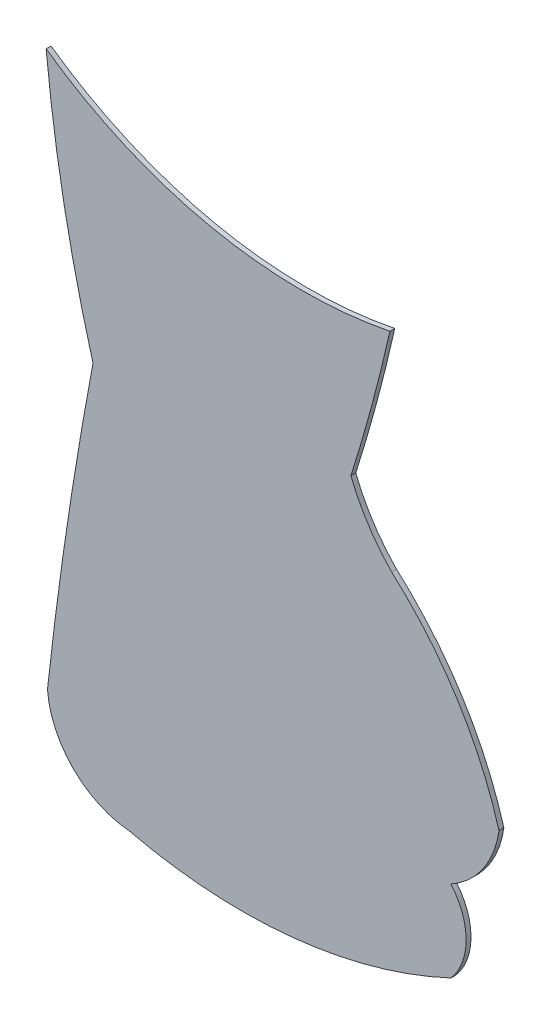
ISO-10303-21;
HEADER;
FILE_DESCRIPTION(('STEP AP214'),'2;1');
FILE_NAME('part.step','',(''),(''),'','','');
FILE_SCHEMA(('AUTOMOTIVE_DESIGN { 1 0 10303 214 1 1 1 1 }'));
ENDSEC;
DATA;
#1=APPLICATION_CONTEXT('core data for automotive mechanical design processes');
#2=APPLICATION_PROTOCOL_DEFINITION('international standard','automotive_design',2000,#1);
#3=PRODUCT_CONTEXT('',#1,'mechanical');
#4=PRODUCT('Part','Part','',(#3));
#5=PRODUCT_RELATED_PRODUCT_CATEGORY('part','',(#4));
#6=PRODUCT_DEFINITION_FORMATION('','',#4);
#7=PRODUCT_DEFINITION_CONTEXT('part definition',#1,'design');
#8=PRODUCT_DEFINITION('design','',#6,#7);
#9=PRODUCT_DEFINITION_SHAPE('','',#8);
#10=(LENGTH_UNIT() NAMED_UNIT(*) SI_UNIT(.MILLI.,.METRE.));
#11=(NAMED_UNIT(*) PLANE_ANGLE_UNIT() SI_UNIT($,.RADIAN.));
#12=(NAMED_UNIT(*) SI_UNIT($,.STERADIAN.) SOLID_ANGLE_UNIT());
#13=UNCERTAINTY_MEASURE_WITH_UNIT(LENGTH_MEASURE(1.E-05),#10,'distance_accuracy_value','');
#14=(GEOMETRIC_REPRESENTATION_CONTEXT(3) GLOBAL_UNCERTAINTY_ASSIGNED_CONTEXT((#13)) GLOBAL_UNIT_ASSIGNED_CONTEXT((#10,
#11,#12)) REPRESENTATION_CONTEXT('',''));
#15=CARTESIAN_POINT('',(0.,0.,0.));
#16=DIRECTION('',(0.,0.,1.));
#17=DIRECTION('',(1.,0.,0.));
#18=AXIS2_PLACEMENT_3D('',#15,#16,#17);
#19=CARTESIAN_POINT('',(34.7356672762744,12.8118184762911,0.1));
#20=DIRECTION('',(0.,0.,-1.));
#21=DIRECTION('',(-1.,0.,0.));
#22=AXIS2_PLACEMENT_3D('',#19,#20,#21);
#23=CYLINDRICAL_SURFACE('',#22,29.051276035575);
#24=CARTESIAN_POINT('',(34.7356672762744,12.8118184762911,0.));
#25=DIRECTION('',(0.,0.,1.));
#26=DIRECTION('',(1.,0.,0.));
#27=AXIS2_PLACEMENT_3D('',#24,#25,#26);
#28=CIRCLE('',#27,29.051276035575);
#29=CARTESIAN_POINT('',(5.82026123844377,10.0054092113117,0.));
#30=VERTEX_POINT('',#29);
#31=CARTESIAN_POINT('',(6.77972887717701,4.90978408500634,0.));
#32=VERTEX_POINT('',#31);
#33=EDGE_CURVE('E141',#30,#32,#28,.T.);
#34=ORIENTED_EDGE('',*,*,#33,.T.);
#35=DIRECTION('',(0.,0.,-1.));
#36=VECTOR('',#35,1.);
#37=CARTESIAN_POINT('',(6.77972887717701,4.90978408500634,0.1));
#38=LINE('',#37,#36);
#39=CARTESIAN_POINT('',(6.77972887717701,4.90978408500634,0.1));
#40=VERTEX_POINT('',#39);
#41=EDGE_CURVE('E11',#40,#32,#38,.T.);
#42=ORIENTED_EDGE('',*,*,#41,.F.);
#43=CARTESIAN_POINT('',(34.7356672762744,12.8118184762911,0.1));
#44=DIRECTION('',(0.,0.,1.));
#45=DIRECTION('',(1.,0.,0.));
#46=AXIS2_PLACEMENT_3D('',#43,#44,#45);
#47=CIRCLE('',#46,29.051276035575);
#48=CARTESIAN_POINT('',(5.82026123844377,10.0054092113117,0.1));
#49=VERTEX_POINT('',#48);
#50=EDGE_CURVE('E159',#49,#40,#47,.T.);
#51=ORIENTED_EDGE('',*,*,#50,.F.);
#52=DIRECTION('',(0.,0.,-1.));
#53=VECTOR('',#52,1.);
#54=CARTESIAN_POINT('',(5.82026123844377,10.0054092113117,0.1));
#55=LINE('',#54,#53);
#56=EDGE_CURVE('E137',#49,#30,#55,.T.);
#57=ORIENTED_EDGE('',*,*,#56,.T.);
#58=EDGE_LOOP('',(#34,#42,#51,#57));
#59=FACE_BOUND('',#58,.T.);
#60=ADVANCED_FACE('F33',(#59),#23,.T.);
#61=CARTESIAN_POINT('',(86.7306070023256,-10.2115855926598,0.1));
#62=DIRECTION('',(0.,0.,-1.));
#63=DIRECTION('',(-1.,0.,0.));
#64=AXIS2_PLACEMENT_3D('',#61,#62,#63);
#65=CYLINDRICAL_SURFACE('',#64,81.3682907151859);
#66=CARTESIAN_POINT('',(86.7306070023256,-10.2115855926598,0.));
#67=DIRECTION('',(0.,0.,1.));
#68=DIRECTION('',(1.,0.,0.));
#69=AXIS2_PLACEMENT_3D('',#66,#67,#68);
#70=CIRCLE('',#69,81.3682907151859);
#71=CARTESIAN_POINT('',(5.84689805543554,-1.34454770474144,0.));
#72=VERTEX_POINT('',#71);
#73=EDGE_CURVE('E144',#32,#72,#70,.T.);
#74=ORIENTED_EDGE('',*,*,#73,.T.);
#75=DIRECTION('',(0.,0.,-1.));
#76=VECTOR('',#75,1.);
#77=CARTESIAN_POINT('',(5.84689805543554,-1.34454770474144,0.1));
#78=LINE('',#77,#76);
#79=CARTESIAN_POINT('',(5.84689805543554,-1.34454770474144,0.1));
#80=VERTEX_POINT('',#79);
#81=EDGE_CURVE('E41',#80,#72,#78,.T.);
#82=ORIENTED_EDGE('',*,*,#81,.F.);
#83=CARTESIAN_POINT('',(86.7306070023256,-10.2115855926598,0.1));
#84=DIRECTION('',(0.,0.,1.));
#85=DIRECTION('',(1.,0.,0.));
#86=AXIS2_PLACEMENT_3D('',#83,#84,#85);
#87=CIRCLE('',#86,81.3682907151859);
#88=EDGE_CURVE('E98',#40,#80,#87,.T.);
#89=ORIENTED_EDGE('',*,*,#88,.F.);
#90=ORIENTED_EDGE('',*,*,#41,.T.);
#91=EDGE_LOOP('',(#74,#82,#89,#90));
#92=FACE_BOUND('',#91,.T.);
#93=ADVANCED_FACE('F208',(#92),#65,.T.);
#94=CARTESIAN_POINT('',(7.66583797220736,-1.19270495592502,0.1));
#95=DIRECTION('',(0.,0.,-1.));
#96=DIRECTION('',(-1.,0.,0.));
#97=AXIS2_PLACEMENT_3D('',#94,#95,#96);
#98=CYLINDRICAL_SURFACE('',#97,1.82526673152008);
#99=CARTESIAN_POINT('',(7.66583797220736,-1.19270495592502,0.));
#100=DIRECTION('',(0.,0.,1.));
#101=DIRECTION('',(1.,0.,0.));
#102=AXIS2_PLACEMENT_3D('',#99,#100,#101);
#103=CIRCLE('',#102,1.82526673152008);
#104=CARTESIAN_POINT('',(7.51452042102269,-3.01168863916615,0.));
#105=VERTEX_POINT('',#104);
#106=EDGE_CURVE('E146',#72,#105,#103,.T.);
#107=ORIENTED_EDGE('',*,*,#106,.T.);
#108=DIRECTION('',(0.,0.,-1.));
#109=VECTOR('',#108,1.);
#110=CARTESIAN_POINT('',(7.51452042102269,-3.01168863916615,0.1));
#111=LINE('',#110,#109);
#112=CARTESIAN_POINT('',(7.51452042102269,-3.01168863916615,0.1));
#113=VERTEX_POINT('',#112);
#114=EDGE_CURVE('E172',#113,#105,#111,.T.);
#115=ORIENTED_EDGE('',*,*,#114,.F.);
#116=CARTESIAN_POINT('',(7.66583797220736,-1.19270495592502,0.1));
#117=DIRECTION('',(0.,0.,1.));
#118=DIRECTION('',(1.,0.,0.));
#119=AXIS2_PLACEMENT_3D('',#116,#117,#118);
#120=CIRCLE('',#119,1.82526673152008);
#121=EDGE_CURVE('E180',#80,#113,#120,.T.);
#122=ORIENTED_EDGE('',*,*,#121,.F.);
#123=ORIENTED_EDGE('',*,*,#81,.T.);
#124=EDGE_LOOP('',(#107,#115,#122,#123));
#125=FACE_BOUND('',#124,.T.);
#126=ADVANCED_FACE('F178',(#125),#98,.T.);
#127=CARTESIAN_POINT('',(9.83260678542086,6.77759891741542,0.1));
#128=DIRECTION('',(0.,0.,-1.));
#129=DIRECTION('',(-1.,0.,0.));
#130=AXIS2_PLACEMENT_3D('',#127,#128,#129);
#131=CYLINDRICAL_SURFACE('',#130,10.0600037404691);
#132=CARTESIAN_POINT('',(9.83260678542086,6.77759891741542,0.));
#133=DIRECTION('',(0.,0.,1.));
#134=DIRECTION('',(1.,0.,0.));
#135=AXIS2_PLACEMENT_3D('',#132,#133,#134);
#136=CIRCLE('',#135,10.0600037404691);
#137=CARTESIAN_POINT('',(14.1081584714902,-2.3286260434562,0.));
#138=VERTEX_POINT('',#137);
#139=EDGE_CURVE('E148',#105,#138,#136,.T.);
#140=ORIENTED_EDGE('',*,*,#139,.T.);
#141=DIRECTION('',(0.,0.,-1.));
#142=VECTOR('',#141,1.);
#143=CARTESIAN_POINT('',(14.1081584714902,-2.3286260434562,0.1));
#144=LINE('',#143,#142);
#145=CARTESIAN_POINT('',(14.1081584714902,-2.3286260434562,0.1));
#146=VERTEX_POINT('',#145);
#147=EDGE_CURVE('E169',#146,#138,#144,.T.);
#148=ORIENTED_EDGE('',*,*,#147,.F.);
#149=CARTESIAN_POINT('',(9.83260678542086,6.77759891741542,0.1));
#150=DIRECTION('',(0.,0.,1.));
#151=DIRECTION('',(1.,0.,0.));
#152=AXIS2_PLACEMENT_3D('',#149,#150,#151);
#153=CIRCLE('',#152,10.0600037404691);
#154=EDGE_CURVE('E198',#113,#146,#153,.T.);
#155=ORIENTED_EDGE('',*,*,#154,.F.);
#156=ORIENTED_EDGE('',*,*,#114,.T.);
#157=EDGE_LOOP('',(#140,#148,#155,#156));
#158=FACE_BOUND('',#157,.T.);
#159=ADVANCED_FACE('F189',(#158),#131,.T.);
#160=CARTESIAN_POINT('',(13.1511884168212,-1.49507335637202,0.1));
#161=DIRECTION('',(0.,0.,-1.));
#162=DIRECTION('',(-1.,0.,0.));
#163=AXIS2_PLACEMENT_3D('',#160,#161,#162);
#164=CYLINDRICAL_SURFACE('',#163,1.26909486157593);
#165=CARTESIAN_POINT('',(13.1511884168212,-1.49507335637202,0.));
#166=DIRECTION('',(0.,0.,1.));
#167=DIRECTION('',(1.,0.,0.));
#168=AXIS2_PLACEMENT_3D('',#165,#166,#167);
#169=CIRCLE('',#168,1.26909486157593);
#170=CARTESIAN_POINT('',(14.1079177559089,-0.66124439345029,0.));
#171=VERTEX_POINT('',#170);
#172=EDGE_CURVE('E150',#138,#171,#169,.T.);
#173=ORIENTED_EDGE('',*,*,#172,.T.);
#174=DIRECTION('',(0.,0.,-1.));
#175=VECTOR('',#174,1.);
#176=CARTESIAN_POINT('',(14.1079177559089,-0.66124439345029,0.1));
#177=LINE('',#176,#175);
#178=CARTESIAN_POINT('',(14.1079177559089,-0.66124439345029,0.1));
#179=VERTEX_POINT('',#178);
#180=EDGE_CURVE('E166',#179,#171,#177,.T.);
#181=ORIENTED_EDGE('',*,*,#180,.F.);
#182=CARTESIAN_POINT('',(13.1511884168212,-1.49507335637202,0.1));
#183=DIRECTION('',(0.,0.,1.));
#184=DIRECTION('',(1.,0.,0.));
#185=AXIS2_PLACEMENT_3D('',#182,#183,#184);
#186=CIRCLE('',#185,1.26909486157593);
#187=EDGE_CURVE('E195',#146,#179,#186,.T.);
#188=ORIENTED_EDGE('',*,*,#187,.F.);
#189=ORIENTED_EDGE('',*,*,#147,.T.);
#190=EDGE_LOOP('',(#173,#181,#188,#189));
#191=FACE_BOUND('',#190,.T.);
#192=ADVANCED_FACE('F193',(#191),#164,.T.);
#193=CARTESIAN_POINT('',(13.1602956320158,1.04389552383913,0.1));
#194=DIRECTION('',(0.,0.,-1.));
#195=DIRECTION('',(-1.,0.,0.));
#196=AXIS2_PLACEMENT_3D('',#193,#194,#195);
#197=CYLINDRICAL_SURFACE('',#196,1.95076647172992);
#198=CARTESIAN_POINT('',(13.1602956320158,1.04389552383913,0.));
#199=DIRECTION('',(0.,0.,1.));
#200=DIRECTION('',(1.,0.,0.));
#201=AXIS2_PLACEMENT_3D('',#198,#199,#200);
#202=CIRCLE('',#201,1.95076647172992);
#203=CARTESIAN_POINT('',(15.0929808401832,0.778909272580059,0.));
#204=VERTEX_POINT('',#203);
#205=EDGE_CURVE('E152',#171,#204,#202,.T.);
#206=ORIENTED_EDGE('',*,*,#205,.T.);
#207=DIRECTION('',(0.,0.,-1.));
#208=VECTOR('',#207,1.);
#209=CARTESIAN_POINT('',(15.0929808401832,0.778909272580059,0.1));
#210=LINE('',#209,#208);
#211=CARTESIAN_POINT('',(15.0929808401832,0.778909272580059,0.1));
#212=VERTEX_POINT('',#211);
#213=EDGE_CURVE('E163',#212,#204,#210,.T.);
#214=ORIENTED_EDGE('',*,*,#213,.F.);
#215=CARTESIAN_POINT('',(13.1602956320158,1.04389552383913,0.1));
#216=DIRECTION('',(0.,0.,1.));
#217=DIRECTION('',(1.,0.,0.));
#218=AXIS2_PLACEMENT_3D('',#215,#216,#217);
#219=CIRCLE('',#218,1.95076647172992);
#220=EDGE_CURVE('E197',#179,#212,#219,.T.);
#221=ORIENTED_EDGE('',*,*,#220,.F.);
#222=ORIENTED_EDGE('',*,*,#180,.T.);
#223=EDGE_LOOP('',(#206,#214,#221,#222));
#224=FACE_BOUND('',#223,.T.);
#225=ADVANCED_FACE('F220',(#224),#197,.T.);
#226=CARTESIAN_POINT('',(7.93953928655324,-1.29609875944495,0.1));
#227=DIRECTION('',(0.,0.,-1.));
#228=DIRECTION('',(-1.,0.,0.));
#229=AXIS2_PLACEMENT_3D('',#226,#227,#228);
#230=CYLINDRICAL_SURFACE('',#229,7.44831419813694);
#231=CARTESIAN_POINT('',(7.93953928655324,-1.29609875944495,0.));
#232=DIRECTION('',(0.,0.,1.));
#233=DIRECTION('',(1.,0.,0.));
#234=AXIS2_PLACEMENT_3D('',#231,#232,#233);
#235=CIRCLE('',#234,7.44831419813694);
#236=CARTESIAN_POINT('',(12.8945653507783,4.26493541568997,0.));
#237=VERTEX_POINT('',#236);
#238=EDGE_CURVE('E154',#204,#237,#235,.T.);
#239=ORIENTED_EDGE('',*,*,#238,.T.);
#240=DIRECTION('',(0.,0.,-1.));
#241=VECTOR('',#240,1.);
#242=CARTESIAN_POINT('',(12.8945653507783,4.26493541568997,0.1));
#243=LINE('',#242,#241);
#244=CARTESIAN_POINT('',(12.8945653507783,4.26493541568997,0.1));
#245=VERTEX_POINT('',#244);
#246=EDGE_CURVE('E132',#245,#237,#243,.T.);
#247=ORIENTED_EDGE('',*,*,#246,.F.);
#248=CARTESIAN_POINT('',(7.93953928655324,-1.29609875944495,0.1));
#249=DIRECTION('',(0.,0.,1.));
#250=DIRECTION('',(1.,0.,0.));
#251=AXIS2_PLACEMENT_3D('',#248,#249,#250);
#252=CIRCLE('',#251,7.44831419813694);
#253=EDGE_CURVE('E123',#212,#245,#252,.T.);
#254=ORIENTED_EDGE('',*,*,#253,.F.);
#255=ORIENTED_EDGE('',*,*,#213,.T.);
#256=EDGE_LOOP('',(#239,#247,#254,#255));
#257=FACE_BOUND('',#256,.T.);
#258=ADVANCED_FACE('F223',(#257),#230,.T.);
#259=CARTESIAN_POINT('',(15.6984042275645,6.99378295554091,0.1));
#260=DIRECTION('',(0.,0.,-1.));
#261=DIRECTION('',(-1.,0.,0.));
#262=AXIS2_PLACEMENT_3D('',#259,#260,#261);
#263=CYLINDRICAL_SURFACE('',#262,3.91255943631892);
#264=CARTESIAN_POINT('',(15.6984042275645,6.99378295554091,0.));
#265=DIRECTION('',(0.,0.,-1.));
#266=DIRECTION('',(1.,0.,0.));
#267=AXIS2_PLACEMENT_3D('',#264,#265,#266);
#268=CIRCLE('',#267,3.91255943631892);
#269=CARTESIAN_POINT('',(12.0606885182808,5.55324633290391,0.));
#270=VERTEX_POINT('',#269);
#271=EDGE_CURVE('E131',#237,#270,#268,.T.);
#272=ORIENTED_EDGE('',*,*,#271,.T.);
#273=DIRECTION('',(0.,0.,-1.));
#274=VECTOR('',#273,1.);
#275=CARTESIAN_POINT('',(12.0606885182808,5.55324633290391,0.1));
#276=LINE('',#275,#274);
#277=CARTESIAN_POINT('',(12.0606885182808,5.55324633290391,0.1));
#278=VERTEX_POINT('',#277);
#279=EDGE_CURVE('E128',#278,#270,#276,.T.);
#280=ORIENTED_EDGE('',*,*,#279,.F.);
#281=CARTESIAN_POINT('',(15.6984042275645,6.99378295554091,0.1));
#282=DIRECTION('',(0.,0.,-1.));
#283=DIRECTION('',(1.,0.,0.));
#284=AXIS2_PLACEMENT_3D('',#281,#282,#283);
#285=CIRCLE('',#284,3.91255943631892);
#286=EDGE_CURVE('E117',#245,#278,#285,.T.);
#287=ORIENTED_EDGE('',*,*,#286,.F.);
#288=ORIENTED_EDGE('',*,*,#246,.T.);
#289=EDGE_LOOP('',(#272,#280,#287,#288));
#290=FACE_BOUND('',#289,.T.);
#291=ADVANCED_FACE('F129',(#290),#263,.F.);
#292=CARTESIAN_POINT('',(-21.740629436875,16.2531946177775,0.1));
#293=DIRECTION('',(0.,0.,-1.));
#294=DIRECTION('',(-1.,0.,0.));
#295=AXIS2_PLACEMENT_3D('',#292,#293,#294);
#296=CYLINDRICAL_SURFACE('',#295,35.4544494923345);
#297=CARTESIAN_POINT('',(-21.740629436875,16.2531946177775,0.));
#298=DIRECTION('',(0.,0.,1.));
#299=DIRECTION('',(1.,0.,0.));
#300=AXIS2_PLACEMENT_3D('',#297,#298,#299);
#301=CIRCLE('',#300,35.4544494923345);
#302=CARTESIAN_POINT('',(12.8593438017243,8.51628045948969,0.));
#303=VERTEX_POINT('',#302);
#304=EDGE_CURVE('E84',#270,#303,#301,.T.);
#305=ORIENTED_EDGE('',*,*,#304,.T.);
#306=DIRECTION('',(0.,0.,-1.));
#307=VECTOR('',#306,1.);
#308=CARTESIAN_POINT('',(12.8593438017243,8.51628045948969,0.1));
#309=LINE('',#308,#307);
#310=CARTESIAN_POINT('',(12.8593438017243,8.51628045948969,0.1));
#311=VERTEX_POINT('',#310);
#312=EDGE_CURVE('E133',#311,#303,#309,.T.);
#313=ORIENTED_EDGE('',*,*,#312,.F.);
#314=CARTESIAN_POINT('',(-21.740629436875,16.2531946177775,0.1));
#315=DIRECTION('',(0.,0.,1.));
#316=DIRECTION('',(1.,0.,0.));
#317=AXIS2_PLACEMENT_3D('',#314,#315,#316);
#318=CIRCLE('',#317,35.4544494923345);
#319=EDGE_CURVE('E121',#278,#311,#318,.T.);
#320=ORIENTED_EDGE('',*,*,#319,.F.);
#321=ORIENTED_EDGE('',*,*,#279,.T.);
#322=EDGE_LOOP('',(#305,#313,#320,#321));
#323=FACE_BOUND('',#322,.T.);
#324=ADVANCED_FACE('F135',(#323),#296,.T.);
#325=CARTESIAN_POINT('',(11.0755485862901,17.4656826333175,0.1));
#326=DIRECTION('',(0.,0.,-1.));
#327=DIRECTION('',(-1.,0.,0.));
#328=AXIS2_PLACEMENT_3D('',#325,#326,#327);
#329=CYLINDRICAL_SURFACE('',#328,9.12544380507161);
#330=CARTESIAN_POINT('',(11.0755485862901,17.4656826333175,0.));
#331=DIRECTION('',(0.,0.,-1.));
#332=DIRECTION('',(1.,0.,0.));
#333=AXIS2_PLACEMENT_3D('',#330,#331,#332);
#334=CIRCLE('',#333,9.12544380507161);
#335=EDGE_CURVE('E90',#303,#30,#334,.T.);
#336=ORIENTED_EDGE('',*,*,#335,.T.);
#337=ORIENTED_EDGE('',*,*,#56,.F.);
#338=CARTESIAN_POINT('',(11.0755485862901,17.4656826333175,0.1));
#339=DIRECTION('',(0.,0.,-1.));
#340=DIRECTION('',(1.,0.,0.));
#341=AXIS2_PLACEMENT_3D('',#338,#339,#340);
#342=CIRCLE('',#341,9.12544380507161);
#343=EDGE_CURVE('E49',#311,#49,#342,.T.);
#344=ORIENTED_EDGE('',*,*,#343,.F.);
#345=ORIENTED_EDGE('',*,*,#312,.T.);
#346=EDGE_LOOP('',(#336,#337,#344,#345));
#347=FACE_BOUND('',#346,.T.);
#348=ADVANCED_FACE('F232',(#347),#329,.F.);
#349=CARTESIAN_POINT('',(60.7331371393,1.30011644181562,0.1));
#350=DIRECTION('',(0.,0.,1.));
#351=DIRECTION('',(1.,0.,0.));
#352=AXIS2_PLACEMENT_3D('',#349,#350,#351);
#353=PLANE('',#352);
#354=ORIENTED_EDGE('',*,*,#50,.T.);
#355=ORIENTED_EDGE('',*,*,#88,.T.);
#356=ORIENTED_EDGE('',*,*,#121,.T.);
#357=ORIENTED_EDGE('',*,*,#154,.T.);
#358=ORIENTED_EDGE('',*,*,#187,.T.);
#359=ORIENTED_EDGE('',*,*,#220,.T.);
#360=ORIENTED_EDGE('',*,*,#253,.T.);
#361=ORIENTED_EDGE('',*,*,#286,.T.);
#362=ORIENTED_EDGE('',*,*,#319,.T.);
#363=ORIENTED_EDGE('',*,*,#343,.T.);
#364=EDGE_LOOP('',(#354,#355,#356,#357,#358,#359,#360,#361,#362,#363));
#365=FACE_BOUND('',#364,.T.);
#366=ADVANCED_FACE('F119',(#365),#353,.T.);
#367=CARTESIAN_POINT('',(60.7331371393,1.30011644181562,0.));
#368=DIRECTION('',(0.,0.,1.));
#369=DIRECTION('',(1.,0.,0.));
#370=AXIS2_PLACEMENT_3D('',#367,#368,#369);
#371=PLANE('',#370);
#372=ORIENTED_EDGE('',*,*,#33,.F.);
#373=ORIENTED_EDGE('',*,*,#335,.F.);
#374=ORIENTED_EDGE('',*,*,#304,.F.);
#375=ORIENTED_EDGE('',*,*,#271,.F.);
#376=ORIENTED_EDGE('',*,*,#238,.F.);
#377=ORIENTED_EDGE('',*,*,#205,.F.);
#378=ORIENTED_EDGE('',*,*,#172,.F.);
#379=ORIENTED_EDGE('',*,*,#139,.F.);
#380=ORIENTED_EDGE('',*,*,#106,.F.);
#381=ORIENTED_EDGE('',*,*,#73,.F.);
#382=EDGE_LOOP('',(#372,#373,#374,#375,#376,#377,#378,#379,#380,#381));
#383=FACE_BOUND('',#382,.T.);
#384=ADVANCED_FACE('F184',(#383),#371,.F.);
#385=CLOSED_SHELL('',(#60,#93,#126,#159,#192,#225,#258,#291,#324,#348,#366,#384));
#386=MANIFOLD_SOLID_BREP('B2',#385);
#387=ADVANCED_BREP_SHAPE_REPRESENTATION('',(#18,#386),#14);
#388=SHAPE_DEFINITION_REPRESENTATION(#9,#387);
ENDSEC;
END-ISO-10303-21;
